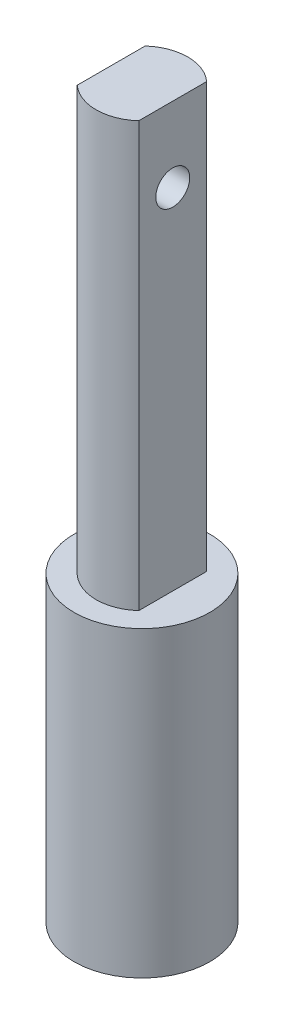
ISO-10303-21;
HEADER;
FILE_DESCRIPTION(('STEP AP214'),'2;1');
FILE_NAME('part.step','',(''),(''),'','','');
FILE_SCHEMA(('AUTOMOTIVE_DESIGN { 1 0 10303 214 1 1 1 1 }'));
ENDSEC;
DATA;
#1=APPLICATION_CONTEXT('core data for automotive mechanical design processes');
#2=APPLICATION_PROTOCOL_DEFINITION('international standard','automotive_design',2000,#1);
#3=PRODUCT_CONTEXT('',#1,'mechanical');
#4=PRODUCT('Part','Part','',(#3));
#5=PRODUCT_RELATED_PRODUCT_CATEGORY('part','',(#4));
#6=PRODUCT_DEFINITION_FORMATION('','',#4);
#7=PRODUCT_DEFINITION_CONTEXT('part definition',#1,'design');
#8=PRODUCT_DEFINITION('design','',#6,#7);
#9=PRODUCT_DEFINITION_SHAPE('','',#8);
#10=(LENGTH_UNIT() NAMED_UNIT(*) SI_UNIT(.MILLI.,.METRE.));
#11=(NAMED_UNIT(*) PLANE_ANGLE_UNIT() SI_UNIT($,.RADIAN.));
#12=(NAMED_UNIT(*) SI_UNIT($,.STERADIAN.) SOLID_ANGLE_UNIT());
#13=UNCERTAINTY_MEASURE_WITH_UNIT(LENGTH_MEASURE(1.E-05),#10,'distance_accuracy_value','');
#14=(GEOMETRIC_REPRESENTATION_CONTEXT(3) GLOBAL_UNCERTAINTY_ASSIGNED_CONTEXT((#13)) GLOBAL_UNIT_ASSIGNED_CONTEXT((#10,
#11,#12)) REPRESENTATION_CONTEXT('',''));
#15=CARTESIAN_POINT('',(0.,0.,0.));
#16=DIRECTION('',(0.,0.,1.));
#17=DIRECTION('',(1.,0.,0.));
#18=AXIS2_PLACEMENT_3D('',#15,#16,#17);
#19=CARTESIAN_POINT('',(0.,0.,0.));
#20=DIRECTION('',(0.,1.,0.));
#21=DIRECTION('',(0.,0.,1.));
#22=AXIS2_PLACEMENT_3D('',#19,#20,#21);
#23=PLANE('',#22);
#24=CARTESIAN_POINT('',(0.,0.,0.));
#25=DIRECTION('',(0.,1.,0.));
#26=DIRECTION('',(0.,0.,1.));
#27=AXIS2_PLACEMENT_3D('',#24,#25,#26);
#28=CIRCLE('',#27,4.);
#29=CARTESIAN_POINT('',(0.,0.,4.));
#30=VERTEX_POINT('',#29);
#31=EDGE_CURVE('E11',#30,#30,#28,.T.);
#32=ORIENTED_EDGE('',*,*,#31,.F.);
#33=EDGE_LOOP('',(#32));
#34=FACE_BOUND('',#33,.T.);
#35=CARTESIAN_POINT('',(0.,0.,0.));
#36=DIRECTION('',(0.,1.,0.));
#37=DIRECTION('',(0.,0.,1.));
#38=AXIS2_PLACEMENT_3D('',#35,#36,#37);
#39=CIRCLE('',#38,2.75);
#40=CARTESIAN_POINT('',(-2.,0.,-1.88745860881769));
#41=VERTEX_POINT('',#40);
#42=CARTESIAN_POINT('',(-2.,0.,1.88745860881769));
#43=VERTEX_POINT('',#42);
#44=EDGE_CURVE('E132',#41,#43,#39,.T.);
#45=ORIENTED_EDGE('',*,*,#44,.T.);
#46=DIRECTION('',(1.,0.,0.));
#47=VECTOR('',#46,1.);
#48=CARTESIAN_POINT('',(-2.,0.,1.88745860881769));
#49=LINE('',#48,#47);
#50=CARTESIAN_POINT('',(2.,0.,1.88745860881769));
#51=VERTEX_POINT('',#50);
#52=EDGE_CURVE('E159',#43,#51,#49,.T.);
#53=ORIENTED_EDGE('',*,*,#52,.T.);
#54=CARTESIAN_POINT('',(0.,0.,0.));
#55=DIRECTION('',(0.,1.,0.));
#56=DIRECTION('',(0.,0.,1.));
#57=AXIS2_PLACEMENT_3D('',#54,#55,#56);
#58=CIRCLE('',#57,2.75);
#59=CARTESIAN_POINT('',(2.,0.,-1.88745860881769));
#60=VERTEX_POINT('',#59);
#61=EDGE_CURVE('E163',#51,#60,#58,.T.);
#62=ORIENTED_EDGE('',*,*,#61,.T.);
#63=DIRECTION('',(-1.,0.,0.));
#64=VECTOR('',#63,1.);
#65=CARTESIAN_POINT('',(-2.,0.,-1.88745860881769));
#66=LINE('',#65,#64);
#67=EDGE_CURVE('E143',#60,#41,#66,.T.);
#68=ORIENTED_EDGE('',*,*,#67,.T.);
#69=EDGE_LOOP('',(#45,#53,#62,#68));
#70=FACE_BOUND('',#69,.T.);
#71=ADVANCED_FACE('F38',(#34,#70),#23,.F.);
#72=CARTESIAN_POINT('',(0.,9.,0.));
#73=DIRECTION('',(0.,-1.,0.));
#74=DIRECTION('',(0.,0.,-1.));
#75=AXIS2_PLACEMENT_3D('',#72,#73,#74);
#76=CYLINDRICAL_SURFACE('',#75,4.);
#77=ORIENTED_EDGE('',*,*,#31,.T.);
#78=EDGE_LOOP('',(#77));
#79=FACE_BOUND('',#78,.T.);
#80=CARTESIAN_POINT('',(0.,17.83,0.));
#81=DIRECTION('',(0.,1.,0.));
#82=DIRECTION('',(0.,0.,1.));
#83=AXIS2_PLACEMENT_3D('',#80,#81,#82);
#84=CIRCLE('',#83,4.);
#85=CARTESIAN_POINT('',(0.,17.83,4.));
#86=VERTEX_POINT('',#85);
#87=EDGE_CURVE('E127',#86,#86,#84,.T.);
#88=ORIENTED_EDGE('',*,*,#87,.F.);
#89=EDGE_LOOP('',(#88));
#90=FACE_BOUND('',#89,.T.);
#91=ADVANCED_FACE('F40',(#79,#90),#76,.T.);
#92=CARTESIAN_POINT('',(0.,9.,0.));
#93=DIRECTION('',(0.,-1.,0.));
#94=DIRECTION('',(0.,0.,-1.));
#95=AXIS2_PLACEMENT_3D('',#92,#93,#94);
#96=CYLINDRICAL_SURFACE('',#95,2.75);
#97=ORIENTED_EDGE('',*,*,#44,.F.);
#98=DIRECTION('',(0.,-1.,0.));
#99=VECTOR('',#98,1.);
#100=CARTESIAN_POINT('',(-2.,9.,-1.88745860881769));
#101=LINE('',#100,#99);
#102=CARTESIAN_POINT('',(-2.,9.,-1.88745860881769));
#103=VERTEX_POINT('',#102);
#104=EDGE_CURVE('E155',#103,#41,#101,.T.);
#105=ORIENTED_EDGE('',*,*,#104,.F.);
#106=CARTESIAN_POINT('',(0.,9.,0.));
#107=DIRECTION('',(0.,1.,0.));
#108=DIRECTION('',(0.,0.,1.));
#109=AXIS2_PLACEMENT_3D('',#106,#107,#108);
#110=CIRCLE('',#109,2.75);
#111=CARTESIAN_POINT('',(-2.,9.,1.88745860881769));
#112=VERTEX_POINT('',#111);
#113=EDGE_CURVE('E138',#103,#112,#110,.T.);
#114=ORIENTED_EDGE('',*,*,#113,.T.);
#115=DIRECTION('',(0.,-1.,0.));
#116=VECTOR('',#115,1.);
#117=CARTESIAN_POINT('',(-2.,9.,1.88745860881769));
#118=LINE('',#117,#116);
#119=EDGE_CURVE('E47',#112,#43,#118,.T.);
#120=ORIENTED_EDGE('',*,*,#119,.T.);
#121=EDGE_LOOP('',(#97,#105,#114,#120));
#122=FACE_BOUND('',#121,.T.);
#123=ADVANCED_FACE('F182',(#122),#96,.F.);
#124=CARTESIAN_POINT('',(-2.,9.,1.88745860881769));
#125=DIRECTION('',(0.,0.,-1.));
#126=DIRECTION('',(-1.,0.,0.));
#127=AXIS2_PLACEMENT_3D('',#124,#125,#126);
#128=PLANE('',#127);
#129=ORIENTED_EDGE('',*,*,#52,.F.);
#130=ORIENTED_EDGE('',*,*,#119,.F.);
#131=DIRECTION('',(1.,0.,0.));
#132=VECTOR('',#131,1.);
#133=CARTESIAN_POINT('',(-2.,9.,1.88745860881769));
#134=LINE('',#133,#132);
#135=CARTESIAN_POINT('',(2.,9.,1.88745860881769));
#136=VERTEX_POINT('',#135);
#137=EDGE_CURVE('E142',#112,#136,#134,.T.);
#138=ORIENTED_EDGE('',*,*,#137,.T.);
#139=DIRECTION('',(0.,-1.,0.));
#140=VECTOR('',#139,1.);
#141=CARTESIAN_POINT('',(2.,9.,1.88745860881769));
#142=LINE('',#141,#140);
#143=EDGE_CURVE('E176',#136,#51,#142,.T.);
#144=ORIENTED_EDGE('',*,*,#143,.T.);
#145=EDGE_LOOP('',(#129,#130,#138,#144));
#146=FACE_BOUND('',#145,.T.);
#147=ADVANCED_FACE('F194',(#146),#128,.T.);
#148=CARTESIAN_POINT('',(0.,9.,0.));
#149=DIRECTION('',(0.,-1.,0.));
#150=DIRECTION('',(0.,0.,-1.));
#151=AXIS2_PLACEMENT_3D('',#148,#149,#150);
#152=CYLINDRICAL_SURFACE('',#151,2.75);
#153=ORIENTED_EDGE('',*,*,#61,.F.);
#154=ORIENTED_EDGE('',*,*,#143,.F.);
#155=CARTESIAN_POINT('',(0.,9.,0.));
#156=DIRECTION('',(0.,1.,0.));
#157=DIRECTION('',(0.,0.,1.));
#158=AXIS2_PLACEMENT_3D('',#155,#156,#157);
#159=CIRCLE('',#158,2.75);
#160=CARTESIAN_POINT('',(2.,9.,-1.88745860881769));
#161=VERTEX_POINT('',#160);
#162=EDGE_CURVE('E147',#136,#161,#159,.T.);
#163=ORIENTED_EDGE('',*,*,#162,.T.);
#164=DIRECTION('',(0.,-1.,0.));
#165=VECTOR('',#164,1.);
#166=CARTESIAN_POINT('',(2.,9.,-1.88745860881769));
#167=LINE('',#166,#165);
#168=EDGE_CURVE('E173',#161,#60,#167,.T.);
#169=ORIENTED_EDGE('',*,*,#168,.T.);
#170=EDGE_LOOP('',(#153,#154,#163,#169));
#171=FACE_BOUND('',#170,.T.);
#172=ADVANCED_FACE('F196',(#171),#152,.F.);
#173=CARTESIAN_POINT('',(-2.,9.,-1.88745860881769));
#174=DIRECTION('',(0.,0.,1.));
#175=DIRECTION('',(1.,0.,0.));
#176=AXIS2_PLACEMENT_3D('',#173,#174,#175);
#177=PLANE('',#176);
#178=ORIENTED_EDGE('',*,*,#67,.F.);
#179=ORIENTED_EDGE('',*,*,#168,.F.);
#180=DIRECTION('',(-1.,0.,0.));
#181=VECTOR('',#180,1.);
#182=CARTESIAN_POINT('',(-2.,9.,-1.88745860881769));
#183=LINE('',#182,#181);
#184=EDGE_CURVE('E151',#161,#103,#183,.T.);
#185=ORIENTED_EDGE('',*,*,#184,.T.);
#186=ORIENTED_EDGE('',*,*,#104,.T.);
#187=EDGE_LOOP('',(#178,#179,#185,#186));
#188=FACE_BOUND('',#187,.T.);
#189=ADVANCED_FACE('F190',(#188),#177,.T.);
#190=CARTESIAN_POINT('',(0.,9.,0.));
#191=DIRECTION('',(0.,1.,0.));
#192=DIRECTION('',(0.,0.,1.));
#193=AXIS2_PLACEMENT_3D('',#190,#191,#192);
#194=PLANE('',#193);
#195=ORIENTED_EDGE('',*,*,#137,.F.);
#196=ORIENTED_EDGE('',*,*,#113,.F.);
#197=ORIENTED_EDGE('',*,*,#184,.F.);
#198=ORIENTED_EDGE('',*,*,#162,.F.);
#199=EDGE_LOOP('',(#195,#196,#197,#198));
#200=FACE_BOUND('',#199,.T.);
#201=ADVANCED_FACE('F192',(#200),#194,.F.);
#202=CARTESIAN_POINT('',(0.,17.83,0.));
#203=DIRECTION('',(0.,1.,0.));
#204=DIRECTION('',(0.,0.,1.));
#205=AXIS2_PLACEMENT_3D('',#202,#203,#204);
#206=PLANE('',#205);
#207=CARTESIAN_POINT('',(0.,17.83,0.));
#208=DIRECTION('',(0.,1.,0.));
#209=DIRECTION('',(0.,0.,1.));
#210=AXIS2_PLACEMENT_3D('',#207,#208,#209);
#211=CIRCLE('',#210,2.7);
#212=CARTESIAN_POINT('',(1.81383571472171,17.83,-2.));
#213=VERTEX_POINT('',#212);
#214=CARTESIAN_POINT('',(-1.81383571472171,17.83,-2.));
#215=VERTEX_POINT('',#214);
#216=EDGE_CURVE('E54',#213,#215,#211,.T.);
#217=ORIENTED_EDGE('',*,*,#216,.F.);
#218=DIRECTION('',(0.,0.,-1.));
#219=VECTOR('',#218,1.);
#220=CARTESIAN_POINT('',(1.81383571472171,17.83,-2.));
#221=LINE('',#220,#219);
#222=CARTESIAN_POINT('',(1.81383571472171,17.83,2.));
#223=VERTEX_POINT('',#222);
#224=EDGE_CURVE('E58',#223,#213,#221,.T.);
#225=ORIENTED_EDGE('',*,*,#224,.F.);
#226=CARTESIAN_POINT('',(0.,17.83,0.));
#227=DIRECTION('',(0.,1.,0.));
#228=DIRECTION('',(0.,0.,1.));
#229=AXIS2_PLACEMENT_3D('',#226,#227,#228);
#230=CIRCLE('',#229,2.7);
#231=CARTESIAN_POINT('',(-1.81383571472171,17.83,2.));
#232=VERTEX_POINT('',#231);
#233=EDGE_CURVE('E327',#232,#223,#230,.T.);
#234=ORIENTED_EDGE('',*,*,#233,.F.);
#235=DIRECTION('',(0.,0.,1.));
#236=VECTOR('',#235,1.);
#237=CARTESIAN_POINT('',(-1.81383571472171,17.83,-2.));
#238=LINE('',#237,#236);
#239=EDGE_CURVE('E316',#215,#232,#238,.T.);
#240=ORIENTED_EDGE('',*,*,#239,.F.);
#241=EDGE_LOOP('',(#217,#225,#234,#240));
#242=FACE_BOUND('',#241,.T.);
#243=ORIENTED_EDGE('',*,*,#87,.T.);
#244=EDGE_LOOP('',(#243));
#245=FACE_BOUND('',#244,.T.);
#246=ADVANCED_FACE('F242',(#242,#245),#206,.T.);
#247=CARTESIAN_POINT('',(0.,42.83,0.));
#248=DIRECTION('',(0.,-1.,0.));
#249=DIRECTION('',(0.,0.,-1.));
#250=AXIS2_PLACEMENT_3D('',#247,#248,#249);
#251=CYLINDRICAL_SURFACE('',#250,2.7);
#252=ORIENTED_EDGE('',*,*,#216,.T.);
#253=DIRECTION('',(0.,-1.,0.));
#254=VECTOR('',#253,1.);
#255=CARTESIAN_POINT('',(-1.81383571472171,42.83,-2.));
#256=LINE('',#255,#254);
#257=CARTESIAN_POINT('',(-1.81383571472171,42.83,-2.));
#258=VERTEX_POINT('',#257);
#259=EDGE_CURVE('E107',#258,#215,#256,.T.);
#260=ORIENTED_EDGE('',*,*,#259,.F.);
#261=CARTESIAN_POINT('',(0.,42.83,0.));
#262=DIRECTION('',(0.,1.,0.));
#263=DIRECTION('',(0.,0.,1.));
#264=AXIS2_PLACEMENT_3D('',#261,#262,#263);
#265=CIRCLE('',#264,2.7);
#266=CARTESIAN_POINT('',(1.81383571472171,42.83,-2.));
#267=VERTEX_POINT('',#266);
#268=EDGE_CURVE('E114',#267,#258,#265,.T.);
#269=ORIENTED_EDGE('',*,*,#268,.F.);
#270=DIRECTION('',(0.,-1.,0.));
#271=VECTOR('',#270,1.);
#272=CARTESIAN_POINT('',(1.81383571472171,42.83,-2.));
#273=LINE('',#272,#271);
#274=EDGE_CURVE('E323',#267,#213,#273,.T.);
#275=ORIENTED_EDGE('',*,*,#274,.T.);
#276=EDGE_LOOP('',(#252,#260,#269,#275));
#277=FACE_BOUND('',#276,.T.);
#278=ADVANCED_FACE('F125',(#277),#251,.T.);
#279=CARTESIAN_POINT('',(-1.81383571472171,42.83,-2.));
#280=DIRECTION('',(1.,0.,0.));
#281=DIRECTION('',(0.,0.,-1.));
#282=AXIS2_PLACEMENT_3D('',#279,#280,#281);
#283=PLANE('',#282);
#284=CARTESIAN_POINT('',(-1.81383571472171,38.4218224355312,0.));
#285=DIRECTION('',(1.,0.,0.));
#286=DIRECTION('',(0.,0.,-1.));
#287=AXIS2_PLACEMENT_3D('',#284,#285,#286);
#288=CIRCLE('',#287,1.);
#289=CARTESIAN_POINT('',(-1.81383571472171,38.4218224355312,-1.));
#290=VERTEX_POINT('',#289);
#291=EDGE_CURVE('E311',#290,#290,#288,.T.);
#292=ORIENTED_EDGE('',*,*,#291,.T.);
#293=EDGE_LOOP('',(#292));
#294=FACE_BOUND('',#293,.T.);
#295=ORIENTED_EDGE('',*,*,#239,.T.);
#296=DIRECTION('',(0.,-1.,0.));
#297=VECTOR('',#296,1.);
#298=CARTESIAN_POINT('',(-1.81383571472171,42.83,2.));
#299=LINE('',#298,#297);
#300=CARTESIAN_POINT('',(-1.81383571472171,42.83,2.));
#301=VERTEX_POINT('',#300);
#302=EDGE_CURVE('E109',#301,#232,#299,.T.);
#303=ORIENTED_EDGE('',*,*,#302,.F.);
#304=DIRECTION('',(0.,0.,1.));
#305=VECTOR('',#304,1.);
#306=CARTESIAN_POINT('',(-1.81383571472171,42.83,-2.));
#307=LINE('',#306,#305);
#308=EDGE_CURVE('E102',#258,#301,#307,.T.);
#309=ORIENTED_EDGE('',*,*,#308,.F.);
#310=ORIENTED_EDGE('',*,*,#259,.T.);
#311=EDGE_LOOP('',(#295,#303,#309,#310));
#312=FACE_BOUND('',#311,.T.);
#313=ADVANCED_FACE('F105',(#294,#312),#283,.F.);
#314=CARTESIAN_POINT('',(0.,42.83,0.));
#315=DIRECTION('',(0.,-1.,0.));
#316=DIRECTION('',(0.,0.,-1.));
#317=AXIS2_PLACEMENT_3D('',#314,#315,#316);
#318=CYLINDRICAL_SURFACE('',#317,2.7);
#319=ORIENTED_EDGE('',*,*,#233,.T.);
#320=DIRECTION('',(0.,-1.,0.));
#321=VECTOR('',#320,1.);
#322=CARTESIAN_POINT('',(1.81383571472171,42.83,2.));
#323=LINE('',#322,#321);
#324=CARTESIAN_POINT('',(1.81383571472171,42.83,2.));
#325=VERTEX_POINT('',#324);
#326=EDGE_CURVE('E134',#325,#223,#323,.T.);
#327=ORIENTED_EDGE('',*,*,#326,.F.);
#328=CARTESIAN_POINT('',(0.,42.83,0.));
#329=DIRECTION('',(0.,1.,0.));
#330=DIRECTION('',(0.,0.,1.));
#331=AXIS2_PLACEMENT_3D('',#328,#329,#330);
#332=CIRCLE('',#331,2.7);
#333=EDGE_CURVE('E113',#301,#325,#332,.T.);
#334=ORIENTED_EDGE('',*,*,#333,.F.);
#335=ORIENTED_EDGE('',*,*,#302,.T.);
#336=EDGE_LOOP('',(#319,#327,#334,#335));
#337=FACE_BOUND('',#336,.T.);
#338=ADVANCED_FACE('F265',(#337),#318,.T.);
#339=CARTESIAN_POINT('',(1.81383571472171,42.83,-2.));
#340=DIRECTION('',(-1.,0.,0.));
#341=DIRECTION('',(0.,0.,1.));
#342=AXIS2_PLACEMENT_3D('',#339,#340,#341);
#343=PLANE('',#342);
#344=CARTESIAN_POINT('',(1.81383571472171,38.4218224355312,0.));
#345=DIRECTION('',(1.,0.,0.));
#346=DIRECTION('',(0.,0.,-1.));
#347=AXIS2_PLACEMENT_3D('',#344,#345,#346);
#348=CIRCLE('',#347,1.);
#349=CARTESIAN_POINT('',(1.81383571472171,38.4218224355312,-1.));
#350=VERTEX_POINT('',#349);
#351=EDGE_CURVE('E308',#350,#350,#348,.T.);
#352=ORIENTED_EDGE('',*,*,#351,.F.);
#353=EDGE_LOOP('',(#352));
#354=FACE_BOUND('',#353,.T.);
#355=ORIENTED_EDGE('',*,*,#224,.T.);
#356=ORIENTED_EDGE('',*,*,#274,.F.);
#357=DIRECTION('',(0.,0.,-1.));
#358=VECTOR('',#357,1.);
#359=CARTESIAN_POINT('',(1.81383571472171,42.83,-2.));
#360=LINE('',#359,#358);
#361=EDGE_CURVE('E119',#325,#267,#360,.T.);
#362=ORIENTED_EDGE('',*,*,#361,.F.);
#363=ORIENTED_EDGE('',*,*,#326,.T.);
#364=EDGE_LOOP('',(#355,#356,#362,#363));
#365=FACE_BOUND('',#364,.T.);
#366=ADVANCED_FACE('F270',(#354,#365),#343,.F.);
#367=CARTESIAN_POINT('',(0.,42.83,0.));
#368=DIRECTION('',(0.,1.,0.));
#369=DIRECTION('',(0.,0.,1.));
#370=AXIS2_PLACEMENT_3D('',#367,#368,#369);
#371=PLANE('',#370);
#372=ORIENTED_EDGE('',*,*,#268,.T.);
#373=ORIENTED_EDGE('',*,*,#308,.T.);
#374=ORIENTED_EDGE('',*,*,#333,.T.);
#375=ORIENTED_EDGE('',*,*,#361,.T.);
#376=EDGE_LOOP('',(#372,#373,#374,#375));
#377=FACE_BOUND('',#376,.T.);
#378=ADVANCED_FACE('F117',(#377),#371,.T.);
#379=CARTESIAN_POINT('',(-23.1861642852783,38.4218224355312,0.));
#380=DIRECTION('',(1.,0.,0.));
#381=DIRECTION('',(0.,0.,-1.));
#382=AXIS2_PLACEMENT_3D('',#379,#380,#381);
#383=CYLINDRICAL_SURFACE('',#382,1.);
#384=ORIENTED_EDGE('',*,*,#351,.T.);
#385=EDGE_LOOP('',(#384));
#386=FACE_BOUND('',#385,.T.);
#387=ORIENTED_EDGE('',*,*,#291,.F.);
#388=EDGE_LOOP('',(#387));
#389=FACE_BOUND('',#388,.T.);
#390=ADVANCED_FACE('F282',(#386,#389),#383,.F.);
#391=CLOSED_SHELL('',(#71,#91,#123,#147,#172,#189,#201,#246,#278,#313,#338,#366,#378,#390));
#392=MANIFOLD_SOLID_BREP('B2',#391);
#393=ADVANCED_BREP_SHAPE_REPRESENTATION('',(#18,#392),#14);
#394=SHAPE_DEFINITION_REPRESENTATION(#9,#393);
ENDSEC;
END-ISO-10303-21;
